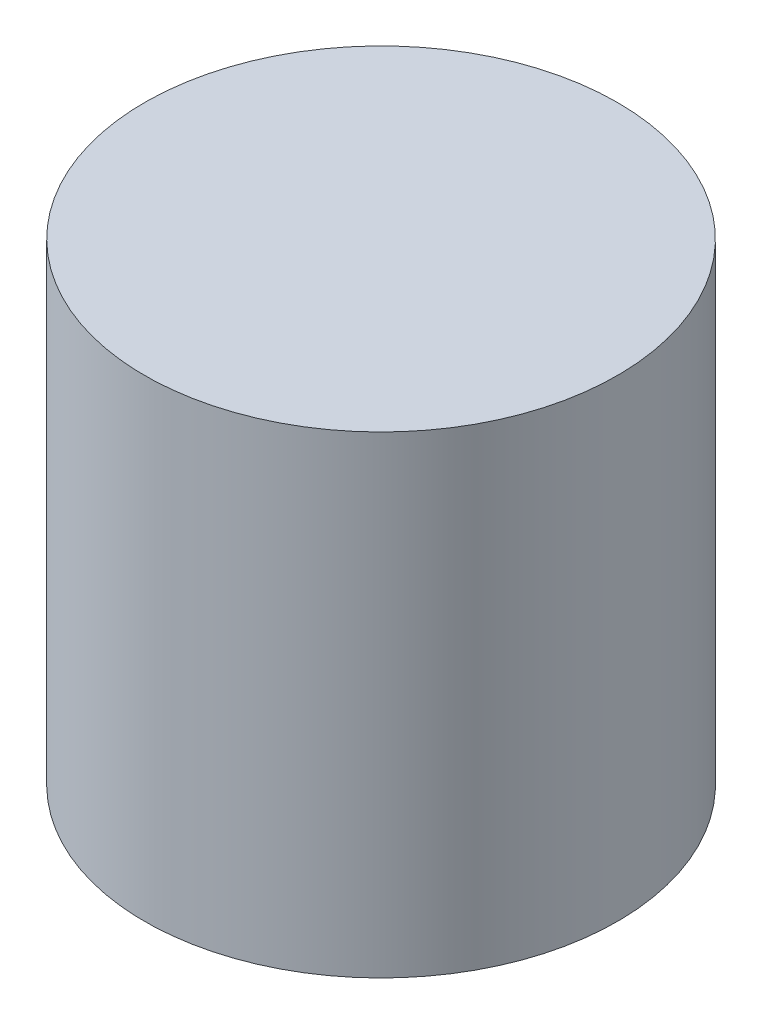
ISO-10303-21;
HEADER;
FILE_DESCRIPTION(('STEP AP214'),'2;1');
FILE_NAME('part.step','',(''),(''),'','','');
FILE_SCHEMA(('AUTOMOTIVE_DESIGN { 1 0 10303 214 1 1 1 1 }'));
ENDSEC;
DATA;
#1=APPLICATION_CONTEXT('core data for automotive mechanical design processes');
#2=APPLICATION_PROTOCOL_DEFINITION('international standard','automotive_design',2000,#1);
#3=PRODUCT_CONTEXT('',#1,'mechanical');
#4=PRODUCT('Part','Part','',(#3));
#5=PRODUCT_RELATED_PRODUCT_CATEGORY('part','',(#4));
#6=PRODUCT_DEFINITION_FORMATION('','',#4);
#7=PRODUCT_DEFINITION_CONTEXT('part definition',#1,'design');
#8=PRODUCT_DEFINITION('design','',#6,#7);
#9=PRODUCT_DEFINITION_SHAPE('','',#8);
#10=(LENGTH_UNIT() NAMED_UNIT(*) SI_UNIT(.MILLI.,.METRE.));
#11=(NAMED_UNIT(*) PLANE_ANGLE_UNIT() SI_UNIT($,.RADIAN.));
#12=(NAMED_UNIT(*) SI_UNIT($,.STERADIAN.) SOLID_ANGLE_UNIT());
#13=UNCERTAINTY_MEASURE_WITH_UNIT(LENGTH_MEASURE(1.E-05),#10,'distance_accuracy_value','');
#14=(GEOMETRIC_REPRESENTATION_CONTEXT(3) GLOBAL_UNCERTAINTY_ASSIGNED_CONTEXT((#13)) GLOBAL_UNIT_ASSIGNED_CONTEXT((#10,
#11,#12)) REPRESENTATION_CONTEXT('',''));
#15=CARTESIAN_POINT('',(0.,0.,0.));
#16=DIRECTION('',(0.,0.,1.));
#17=DIRECTION('',(1.,0.,0.));
#18=AXIS2_PLACEMENT_3D('',#15,#16,#17);
#19=CARTESIAN_POINT('',(0.,-90.0000000000001,-235.));
#20=DIRECTION('',(0.,-1.,0.));
#21=DIRECTION('',(0.,0.,-1.));
#22=AXIS2_PLACEMENT_3D('',#19,#20,#21);
#23=CYLINDRICAL_SURFACE('',#22,75.);
#24=CARTESIAN_POINT('',(0.,-90.0000000000001,-235.));
#25=DIRECTION('',(0.,-1.,0.));
#26=DIRECTION('',(0.,0.,-1.));
#27=AXIS2_PLACEMENT_3D('',#24,#25,#26);
#28=CIRCLE('',#27,75.);
#29=CARTESIAN_POINT('',(0.,-90.0000000000001,-310.));
#30=VERTEX_POINT('',#29);
#31=EDGE_CURVE('E10',#30,#30,#28,.T.);
#32=ORIENTED_EDGE('',*,*,#31,.T.);
#33=EDGE_LOOP('',(#32));
#34=FACE_BOUND('',#33,.T.);
#35=CARTESIAN_POINT('',(0.,-240.,-235.));
#36=DIRECTION('',(0.,-1.,0.));
#37=DIRECTION('',(0.,0.,-1.));
#38=AXIS2_PLACEMENT_3D('',#35,#36,#37);
#39=CIRCLE('',#38,75.);
#40=CARTESIAN_POINT('',(0.,-240.,-310.));
#41=VERTEX_POINT('',#40);
#42=EDGE_CURVE('E34',#41,#41,#39,.T.);
#43=ORIENTED_EDGE('',*,*,#42,.F.);
#44=EDGE_LOOP('',(#43));
#45=FACE_BOUND('',#44,.T.);
#46=ADVANCED_FACE('F31',(#34,#45),#23,.T.);
#47=CARTESIAN_POINT('',(0.,-90.0000000000001,-235.));
#48=DIRECTION('',(0.,-1.,0.));
#49=DIRECTION('',(0.,0.,-1.));
#50=AXIS2_PLACEMENT_3D('',#47,#48,#49);
#51=PLANE('',#50);
#52=ORIENTED_EDGE('',*,*,#31,.F.);
#53=EDGE_LOOP('',(#52));
#54=FACE_BOUND('',#53,.T.);
#55=ADVANCED_FACE('F46',(#54),#51,.F.);
#56=CARTESIAN_POINT('',(0.,-240.,-235.));
#57=DIRECTION('',(0.,-1.,0.));
#58=DIRECTION('',(0.,0.,-1.));
#59=AXIS2_PLACEMENT_3D('',#56,#57,#58);
#60=PLANE('',#59);
#61=ORIENTED_EDGE('',*,*,#42,.T.);
#62=EDGE_LOOP('',(#61));
#63=FACE_BOUND('',#62,.T.);
#64=ADVANCED_FACE('F43',(#63),#60,.T.);
#65=CLOSED_SHELL('',(#46,#55,#64));
#66=MANIFOLD_SOLID_BREP('B2',#65);
#67=ADVANCED_BREP_SHAPE_REPRESENTATION('',(#18,#66),#14);
#68=SHAPE_DEFINITION_REPRESENTATION(#9,#67);
ENDSEC;
END-ISO-10303-21;
